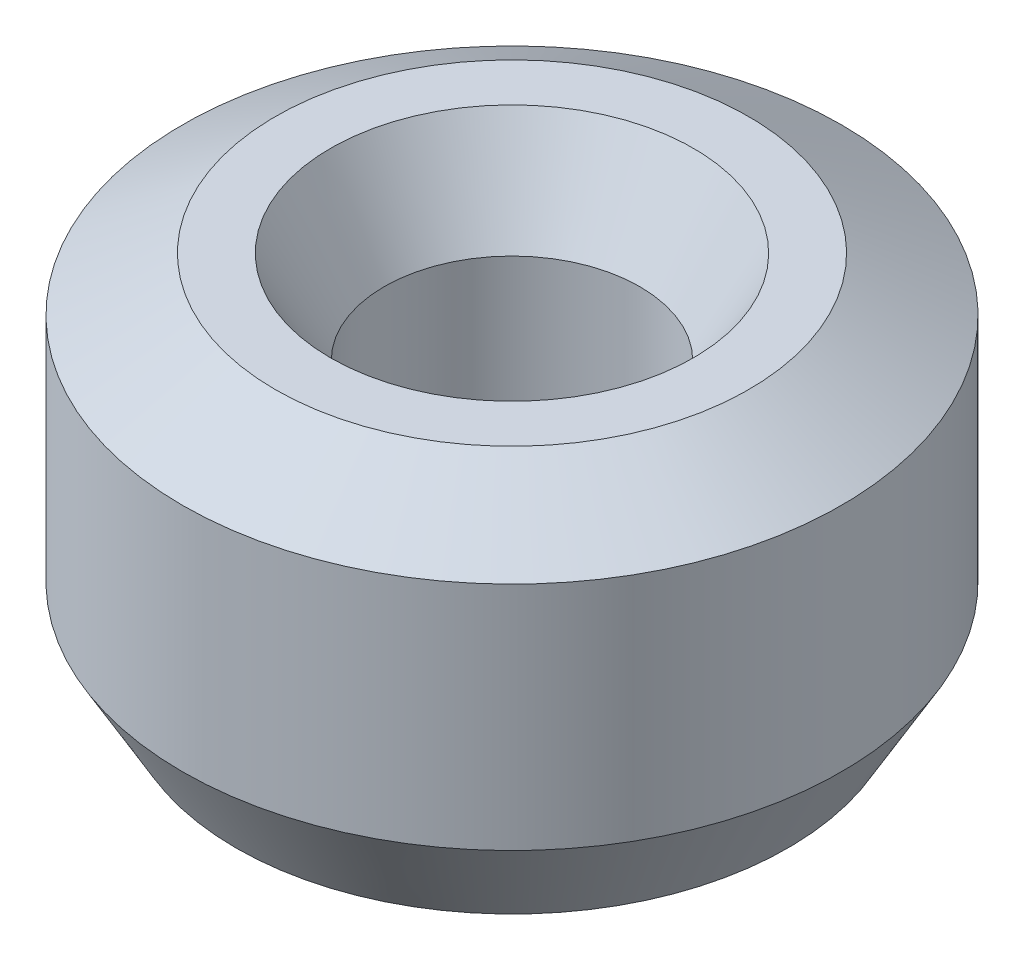
ISO-10303-21;
HEADER;
FILE_DESCRIPTION(('STEP AP214'),'2;1');
FILE_NAME('part.step','',(''),(''),'','','');
FILE_SCHEMA(('AUTOMOTIVE_DESIGN { 1 0 10303 214 1 1 1 1 }'));
ENDSEC;
DATA;
#1=APPLICATION_CONTEXT('core data for automotive mechanical design processes');
#2=APPLICATION_PROTOCOL_DEFINITION('international standard','automotive_design',2000,#1);
#3=PRODUCT_CONTEXT('',#1,'mechanical');
#4=PRODUCT('Part','Part','',(#3));
#5=PRODUCT_RELATED_PRODUCT_CATEGORY('part','',(#4));
#6=PRODUCT_DEFINITION_FORMATION('','',#4);
#7=PRODUCT_DEFINITION_CONTEXT('part definition',#1,'design');
#8=PRODUCT_DEFINITION('design','',#6,#7);
#9=PRODUCT_DEFINITION_SHAPE('','',#8);
#10=(LENGTH_UNIT() NAMED_UNIT(*) SI_UNIT(.MILLI.,.METRE.));
#11=(NAMED_UNIT(*) PLANE_ANGLE_UNIT() SI_UNIT($,.RADIAN.));
#12=(NAMED_UNIT(*) SI_UNIT($,.STERADIAN.) SOLID_ANGLE_UNIT());
#13=UNCERTAINTY_MEASURE_WITH_UNIT(LENGTH_MEASURE(1.E-05),#10,'distance_accuracy_value','');
#14=(GEOMETRIC_REPRESENTATION_CONTEXT(3) GLOBAL_UNCERTAINTY_ASSIGNED_CONTEXT((#13)) GLOBAL_UNIT_ASSIGNED_CONTEXT((#10,
#11,#12)) REPRESENTATION_CONTEXT('',''));
#15=CARTESIAN_POINT('',(0.,0.,0.));
#16=DIRECTION('',(0.,0.,1.));
#17=DIRECTION('',(1.,0.,0.));
#18=AXIS2_PLACEMENT_3D('',#15,#16,#17);
#19=CARTESIAN_POINT('',(0.,25.7634811904174,0.));
#20=DIRECTION('',(0.,-1.,0.));
#21=DIRECTION('',(0.,0.,-1.));
#22=AXIS2_PLACEMENT_3D('',#19,#20,#21);
#23=CYLINDRICAL_SURFACE('',#22,22.5);
#24=CARTESIAN_POINT('',(0.,6.34631982190662,0.));
#25=DIRECTION('',(0.,1.,0.));
#26=DIRECTION('',(0.,0.,1.));
#27=AXIS2_PLACEMENT_3D('',#24,#25,#26);
#28=CIRCLE('',#27,22.5);
#29=CARTESIAN_POINT('',(0.,6.34631982190662,22.5));
#30=VERTEX_POINT('',#29);
#31=EDGE_CURVE('E10',#30,#30,#28,.T.);
#32=ORIENTED_EDGE('',*,*,#31,.T.);
#33=EDGE_LOOP('',(#32));
#34=FACE_BOUND('',#33,.T.);
#35=CARTESIAN_POINT('',(0.,22.0994317328762,0.));
#36=DIRECTION('',(0.,1.,0.));
#37=DIRECTION('',(0.,0.,1.));
#38=AXIS2_PLACEMENT_3D('',#35,#36,#37);
#39=CIRCLE('',#38,22.5);
#40=CARTESIAN_POINT('',(0.,22.0994317328762,22.5));
#41=VERTEX_POINT('',#40);
#42=EDGE_CURVE('E50',#41,#41,#39,.F.);
#43=ORIENTED_EDGE('',*,*,#42,.T.);
#44=EDGE_LOOP('',(#43));
#45=FACE_BOUND('',#44,.T.);
#46=ADVANCED_FACE('F39',(#34,#45),#23,.T.);
#47=CARTESIAN_POINT('',(0.,25.7634811904174,0.));
#48=DIRECTION('',(0.,1.,0.));
#49=DIRECTION('',(0.,0.,1.));
#50=AXIS2_PLACEMENT_3D('',#47,#48,#49);
#51=PLANE('',#50);
#52=CARTESIAN_POINT('',(0.,25.7634811904174,0.));
#53=DIRECTION('',(0.,1.,0.));
#54=DIRECTION('',(0.,0.,1.));
#55=AXIS2_PLACEMENT_3D('',#52,#53,#54);
#56=CIRCLE('',#55,12.3922913216599);
#57=CARTESIAN_POINT('',(0.,25.7634811904174,12.3922913216599));
#58=VERTEX_POINT('',#57);
#59=EDGE_CURVE('E58',#58,#58,#56,.F.);
#60=ORIENTED_EDGE('',*,*,#59,.T.);
#61=EDGE_LOOP('',(#60));
#62=FACE_BOUND('',#61,.T.);
#63=CARTESIAN_POINT('',(0.,25.7634811904174,0.));
#64=DIRECTION('',(0.,1.,0.));
#65=DIRECTION('',(0.,0.,1.));
#66=AXIS2_PLACEMENT_3D('',#63,#64,#65);
#67=CIRCLE('',#66,16.1536801780934);
#68=CARTESIAN_POINT('',(0.,25.7634811904174,16.1536801780934));
#69=VERTEX_POINT('',#68);
#70=EDGE_CURVE('E61',#69,#69,#67,.T.);
#71=ORIENTED_EDGE('',*,*,#70,.T.);
#72=EDGE_LOOP('',(#71));
#73=FACE_BOUND('',#72,.T.);
#74=ADVANCED_FACE('F88',(#62,#73),#51,.T.);
#75=CARTESIAN_POINT('',(0.,0.,0.));
#76=DIRECTION('',(0.,1.,0.));
#77=DIRECTION('',(0.,0.,1.));
#78=AXIS2_PLACEMENT_3D('',#75,#76,#77);
#79=PLANE('',#78);
#80=CARTESIAN_POINT('',(0.,0.,0.));
#81=DIRECTION('',(0.,1.,0.));
#82=DIRECTION('',(0.,0.,1.));
#83=AXIS2_PLACEMENT_3D('',#80,#81,#82);
#84=CIRCLE('',#83,15.0745616860252);
#85=CARTESIAN_POINT('',(0.,0.,-15.0745616860252));
#86=VERTEX_POINT('',#85);
#87=EDGE_CURVE('E51',#86,#86,#84,.T.);
#88=ORIENTED_EDGE('',*,*,#87,.T.);
#89=EDGE_LOOP('',(#88));
#90=FACE_BOUND('',#89,.T.);
#91=CARTESIAN_POINT('',(0.,0.,0.));
#92=DIRECTION('',(0.,1.,0.));
#93=DIRECTION('',(0.,0.,1.));
#94=AXIS2_PLACEMENT_3D('',#91,#92,#93);
#95=CIRCLE('',#94,18.8359505424587);
#96=CARTESIAN_POINT('',(0.,0.,18.8359505424587));
#97=VERTEX_POINT('',#96);
#98=EDGE_CURVE('E54',#97,#97,#95,.F.);
#99=ORIENTED_EDGE('',*,*,#98,.T.);
#100=EDGE_LOOP('',(#99));
#101=FACE_BOUND('',#100,.T.);
#102=ADVANCED_FACE('F83',(#90,#101),#79,.F.);
#103=CARTESIAN_POINT('',(0.,25.7634811904174,0.));
#104=DIRECTION('',(0.,-1.,0.));
#105=DIRECTION('',(0.,0.,-1.));
#106=AXIS2_PLACEMENT_3D('',#103,#104,#105);
#107=CYLINDRICAL_SURFACE('',#106,8.72824186411862);
#108=CARTESIAN_POINT('',(0.,19.4171613685109,0.));
#109=DIRECTION('',(0.,1.,0.));
#110=DIRECTION('',(0.,0.,1.));
#111=AXIS2_PLACEMENT_3D('',#108,#109,#110);
#112=CIRCLE('',#111,8.72824186411862);
#113=CARTESIAN_POINT('',(0.,19.4171613685109,8.72824186411862));
#114=VERTEX_POINT('',#113);
#115=EDGE_CURVE('E67',#114,#114,#112,.T.);
#116=ORIENTED_EDGE('',*,*,#115,.T.);
#117=EDGE_LOOP('',(#116));
#118=FACE_BOUND('',#117,.T.);
#119=CARTESIAN_POINT('',(0.,3.66404945754126,0.));
#120=DIRECTION('',(0.,1.,0.));
#121=DIRECTION('',(0.,0.,1.));
#122=AXIS2_PLACEMENT_3D('',#119,#120,#121);
#123=CIRCLE('',#122,8.72824186411862);
#124=CARTESIAN_POINT('',(0.,3.66404945754126,-8.72824186411862));
#125=VERTEX_POINT('',#124);
#126=EDGE_CURVE('E69',#125,#125,#123,.F.);
#127=ORIENTED_EDGE('',*,*,#126,.T.);
#128=EDGE_LOOP('',(#127));
#129=FACE_BOUND('',#128,.T.);
#130=ADVANCED_FACE('F71',(#118,#129),#107,.F.);
#131=CARTESIAN_POINT('',(0.,19.4171613685109,0.));
#132=DIRECTION('',(0.,1.,0.));
#133=DIRECTION('',(0.,0.,1.));
#134=AXIS2_PLACEMENT_3D('',#131,#132,#133);
#135=CONICAL_SURFACE('',#134,8.72824186411862,0.523598775598302);
#136=ORIENTED_EDGE('',*,*,#59,.F.);
#137=EDGE_LOOP('',(#136));
#138=FACE_BOUND('',#137,.T.);
#139=ORIENTED_EDGE('',*,*,#115,.F.);
#140=EDGE_LOOP('',(#139));
#141=FACE_BOUND('',#140,.T.);
#142=ADVANCED_FACE('F77',(#138,#141),#135,.F.);
#143=CARTESIAN_POINT('',(0.,0.,0.));
#144=DIRECTION('',(0.,-1.,0.));
#145=DIRECTION('',(0.,0.,-1.));
#146=AXIS2_PLACEMENT_3D('',#143,#144,#145);
#147=CONICAL_SURFACE('',#146,15.0745616860252,1.04719755119659);
#148=CARTESIAN_POINT('',(0.,3.66404945754126,-8.72824186411862));
#149=CARTESIAN_POINT('',(0.,3.62588227569187,-8.79434936226347));
#150=CARTESIAN_POINT('',(0.,3.58771509384248,-8.86045686040834));
#151=CARTESIAN_POINT('',(0.,3.5113807301437,-8.99267185669805));
#152=CARTESIAN_POINT('',(0.,3.47321354829432,-9.05877935484292));
#153=CARTESIAN_POINT('',(0.,3.39687918459554,-9.19099435113264));
#154=CARTESIAN_POINT('',(0.,3.35871200274615,-9.2571018492775));
#155=CARTESIAN_POINT('',(0.,3.28237763904738,-9.38931684556722));
#156=CARTESIAN_POINT('',(0.,3.24421045719799,-9.45542434371208));
#157=CARTESIAN_POINT('',(0.,3.16787609349921,-9.5876393400018));
#158=CARTESIAN_POINT('',(0.,3.12970891164982,-9.65374683814666));
#159=CARTESIAN_POINT('',(0.,3.05337454795105,-9.78596183443638));
#160=CARTESIAN_POINT('',(0.,3.01520736610166,-9.85206933258124));
#161=CARTESIAN_POINT('',(0.,2.93887300240288,-9.98428432887096));
#162=CARTESIAN_POINT('',(0.,2.90070582055349,-10.0503918270158));
#163=CARTESIAN_POINT('',(0.,2.82437145685472,-10.1826068233055));
#164=CARTESIAN_POINT('',(0.,2.78620427500533,-10.2487143214504));
#165=CARTESIAN_POINT('',(0.,2.70986991130655,-10.3809293177401));
#166=CARTESIAN_POINT('',(0.,2.67170272945717,-10.447036815885));
#167=CARTESIAN_POINT('',(0.,2.59536836575839,-10.5792518121747));
#168=CARTESIAN_POINT('',(0.,2.557201183909,-10.6453593103196));
#169=CARTESIAN_POINT('',(0.,2.48086682021023,-10.7775743066093));
#170=CARTESIAN_POINT('',(0.,2.44269963836084,-10.8436818047541));
#171=CARTESIAN_POINT('',(0.,2.36636527466206,-10.9758968010439));
#172=CARTESIAN_POINT('',(0.,2.32819809281267,-11.0420042991887));
#173=CARTESIAN_POINT('',(0.,2.2518637291139,-11.1742192954784));
#174=CARTESIAN_POINT('',(0.,2.21369654726451,-11.2403267936233));
#175=CARTESIAN_POINT('',(0.,2.13736218356573,-11.372541789913));
#176=CARTESIAN_POINT('',(0.,2.09919500171634,-11.4386492880579));
#177=CARTESIAN_POINT('',(0.,2.02286063801757,-11.5708642843476));
#178=CARTESIAN_POINT('',(0.,1.98469345616818,-11.6369717824925));
#179=CARTESIAN_POINT('',(0.,1.9083590924694,-11.7691867787822));
#180=CARTESIAN_POINT('',(0.,1.87019191062002,-11.835294276927));
#181=CARTESIAN_POINT('',(0.,1.79385754692124,-11.9675092732168));
#182=CARTESIAN_POINT('',(0.,1.75569036507185,-12.0336167713616));
#183=CARTESIAN_POINT('',(0.,1.67935600137308,-12.1658317676513));
#184=CARTESIAN_POINT('',(0.,1.64118881952369,-12.2319392657962));
#185=CARTESIAN_POINT('',(0.,1.56485445582491,-12.3641542620859));
#186=CARTESIAN_POINT('',(0.,1.52668727397552,-12.4302617602308));
#187=CARTESIAN_POINT('',(0.,1.45035291027675,-12.5624767565205));
#188=CARTESIAN_POINT('',(0.,1.41218572842736,-12.6285842546654));
#189=CARTESIAN_POINT('',(0.,1.33585136472858,-12.7607992509551));
#190=CARTESIAN_POINT('',(0.,1.2976841828792,-12.8269067491));
#191=CARTESIAN_POINT('',(0.,1.22134981918042,-12.9591217453897));
#192=CARTESIAN_POINT('',(0.,1.18318263733103,-13.0252292435345));
#193=CARTESIAN_POINT('',(0.,1.10684827363225,-13.1574442398243));
#194=CARTESIAN_POINT('',(0.,1.06868109178287,-13.2235517379691));
#195=CARTESIAN_POINT('',(0.,0.99234672808409,-13.3557667342588));
#196=CARTESIAN_POINT('',(0.,0.954179546234702,-13.4218742324037));
#197=CARTESIAN_POINT('',(0.,0.877845182535926,-13.5540892286934));
#198=CARTESIAN_POINT('',(0.,0.839678000686538,-13.6201967268383));
#199=CARTESIAN_POINT('',(0.,0.763343636987762,-13.752411723128));
#200=CARTESIAN_POINT('',(0.,0.725176455138374,-13.8185192212729));
#201=CARTESIAN_POINT('',(0.,0.648842091439598,-13.9507342175626));
#202=CARTESIAN_POINT('',(0.,0.610674909590209,-14.0168417157074));
#203=CARTESIAN_POINT('',(0.,0.534340545891433,-14.1490567119972));
#204=CARTESIAN_POINT('',(0.,0.496173364042045,-14.215164210142));
#205=CARTESIAN_POINT('',(0.,0.419839000343269,-14.3473792064317));
#206=CARTESIAN_POINT('',(0.,0.381671818493881,-14.4134867045766));
#207=CARTESIAN_POINT('',(0.,0.305337454795105,-14.5457017008663));
#208=CARTESIAN_POINT('',(0.,0.267170272945717,-14.6118091990112));
#209=CARTESIAN_POINT('',(0.,0.19083590924694,-14.7440241953009));
#210=CARTESIAN_POINT('',(0.,0.152668727397552,-14.8101316934458));
#211=CARTESIAN_POINT('',(0.,0.0763343636987762,-14.9423466897355));
#212=CARTESIAN_POINT('',(0.,0.0381671818493881,-15.0084541878803));
#213=CARTESIAN_POINT('',(0.,0.,-15.0745616860252));
#214=B_SPLINE_CURVE_WITH_KNOTS('',3,(#148,#149,#150,#151,#152,#153,#154,#155,#156,#157,#158,
#159,#160,#161,#162,#163,#164,#165,#166,#167,#168,#169,#170,#171,#172,#173,#174,#175,#176,#177,
#178,#179,#180,#181,#182,#183,#184,#185,#186,#187,#188,#189,#190,#191,#192,#193,#194,#195,#196,
#197,#198,#199,#200,#201,#202,#203,#204,#205,#206,#207,#208,#209,#210,#211,#212,#213),
.UNSPECIFIED.,.F.,.F.,(4,2,2,2,2,2,2,2,2,2,2,2,2,2,2,2,2,2,2,2,2,2,2,2,2,2,2,2,2,2,2,2,4),(0.,
0.229003091096327,0.458006182192654,0.687009273288981,0.916012364385309,1.14501545548164,
1.37401854657796,1.60302163767429,1.83202472877062,2.06102781986694,2.29003091096327,
2.5190340020596,2.74803709315593,2.97704018425225,3.20604327534858,3.43504636644491,
3.66404945754123,3.89305254863756,4.12205563973389,4.35105873083022,4.58006182192654,
4.80906491302287,5.0380680041192,5.26707109521552,5.49607418631185,5.72507727740818,
5.9540803685045,6.18308345960083,6.41208655069716,6.64108964179348,6.87009273288981,
7.09909582398614,7.32809891508246),.UNSPECIFIED.);
#215=EDGE_CURVE('BSEAM73',#125,#86,#214,.T.);
#216=ORIENTED_EDGE('',*,*,#126,.F.);
#217=ORIENTED_EDGE('',*,*,#87,.F.);
#218=ORIENTED_EDGE('',*,*,#215,.T.);
#219=ORIENTED_EDGE('',*,*,#215,.F.);
#220=EDGE_LOOP('',(#216,#218,#217,#219));
#221=FACE_BOUND('',#220,.T.);
#222=ADVANCED_FACE('F73',(#221),#147,.F.);
#223=CARTESIAN_POINT('',(0.,6.34631982190662,0.));
#224=DIRECTION('',(0.,1.,0.));
#225=DIRECTION('',(0.,0.,1.));
#226=AXIS2_PLACEMENT_3D('',#223,#224,#225);
#227=CONICAL_SURFACE('',#226,22.5,0.523598775598302);
#228=CARTESIAN_POINT('',(0.,0.,18.8359505424587));
#229=CARTESIAN_POINT('',(0.,0.0661074981448602,18.8741177243081));
#230=CARTESIAN_POINT('',(0.,0.132214996289721,18.9122849061575));
#231=CARTESIAN_POINT('',(0.,0.264429992579442,18.9886192698563));
#232=CARTESIAN_POINT('',(0.,0.330537490724302,19.0267864517057));
#233=CARTESIAN_POINT('',(0.,0.462752487014023,19.1031208154044));
#234=CARTESIAN_POINT('',(0.,0.528859985158884,19.1412879972538));
#235=CARTESIAN_POINT('',(0.,0.661074981448605,19.2176223609526));
#236=CARTESIAN_POINT('',(0.,0.727182479593465,19.255789542802));
#237=CARTESIAN_POINT('',(0.,0.859397475883187,19.3321239065008));
#238=CARTESIAN_POINT('',(0.,0.925504974028047,19.3702910883502));
#239=CARTESIAN_POINT('',(0.,1.05771997031777,19.4466254520489));
#240=CARTESIAN_POINT('',(0.,1.12382746846263,19.4847926338983));
#241=CARTESIAN_POINT('',(0.,1.25604246475235,19.5611269975971));
#242=CARTESIAN_POINT('',(0.,1.32214996289721,19.5992941794465));
#243=CARTESIAN_POINT('',(0.,1.45436495918693,19.6756285431453));
#244=CARTESIAN_POINT('',(0.,1.52047245733179,19.7137957249947));
#245=CARTESIAN_POINT('',(0.,1.65268745362151,19.7901300886934));
#246=CARTESIAN_POINT('',(0.,1.71879495176637,19.8282972705428));
#247=CARTESIAN_POINT('',(0.,1.8510099480561,19.9046316342416));
#248=CARTESIAN_POINT('',(0.,1.91711744620096,19.942798816091));
#249=CARTESIAN_POINT('',(0.,2.04933244249068,20.0191331797898));
#250=CARTESIAN_POINT('',(0.,2.11543994063554,20.0573003616392));
#251=CARTESIAN_POINT('',(0.,2.24765493692526,20.1336347253379));
#252=CARTESIAN_POINT('',(0.,2.31376243507012,20.1718019071873));
#253=CARTESIAN_POINT('',(0.,2.44597743135984,20.2481362708861));
#254=CARTESIAN_POINT('',(0.,2.5120849295047,20.2863034527355));
#255=CARTESIAN_POINT('',(0.,2.64429992579442,20.3626378164343));
#256=CARTESIAN_POINT('',(0.,2.71040742393928,20.4008049982836));
#257=CARTESIAN_POINT('',(0.,2.842622420229,20.4771393619824));
#258=CARTESIAN_POINT('',(0.,2.90872991837387,20.5153065438318));
#259=CARTESIAN_POINT('',(0.,3.04094491466359,20.5916409075306));
#260=CARTESIAN_POINT('',(0.,3.10705241280845,20.62980808938));
#261=CARTESIAN_POINT('',(0.,3.23926740909817,20.7061424530788));
#262=CARTESIAN_POINT('',(0.,3.30537490724303,20.7443096349281));
#263=CARTESIAN_POINT('',(0.,3.43758990353275,20.8206439986269));
#264=CARTESIAN_POINT('',(0.,3.50369740167761,20.8588111804763));
#265=CARTESIAN_POINT('',(0.,3.63591239796733,20.9351455441751));
#266=CARTESIAN_POINT('',(0.,3.70201989611219,20.9733127260245));
#267=CARTESIAN_POINT('',(0.,3.83423489240191,21.0496470897232));
#268=CARTESIAN_POINT('',(0.,3.90034239054677,21.0878142715726));
#269=CARTESIAN_POINT('',(0.,4.0325573868365,21.1641486352714));
#270=CARTESIAN_POINT('',(0.,4.09866488498136,21.2023158171208));
#271=CARTESIAN_POINT('',(0.,4.23087988127108,21.2786501808196));
#272=CARTESIAN_POINT('',(0.,4.29698737941594,21.316817362669));
#273=CARTESIAN_POINT('',(0.,4.42920237570566,21.3931517263677));
#274=CARTESIAN_POINT('',(0.,4.49530987385052,21.4313189082171));
#275=CARTESIAN_POINT('',(0.,4.62752487014024,21.5076532719159));
#276=CARTESIAN_POINT('',(0.,4.6936323682851,21.5458204537653));
#277=CARTESIAN_POINT('',(0.,4.82584736457482,21.6221548174641));
#278=CARTESIAN_POINT('',(0.,4.89195486271968,21.6603219993135));
#279=CARTESIAN_POINT('',(0.,5.0241698590094,21.7366563630122));
#280=CARTESIAN_POINT('',(0.,5.09027735715426,21.7748235448616));
#281=CARTESIAN_POINT('',(0.,5.22249235344399,21.8511579085604));
#282=CARTESIAN_POINT('',(0.,5.28859985158885,21.8893250904098));
#283=CARTESIAN_POINT('',(0.,5.42081484787857,21.9656594541086));
#284=CARTESIAN_POINT('',(0.,5.48692234602343,22.003826635958));
#285=CARTESIAN_POINT('',(0.,5.61913734231315,22.0801609996567));
#286=CARTESIAN_POINT('',(0.,5.68524484045801,22.1183281815061));
#287=CARTESIAN_POINT('',(0.,5.81745983674773,22.1946625452049));
#288=CARTESIAN_POINT('',(0.,5.88356733489259,22.2328297270543));
#289=CARTESIAN_POINT('',(0.,6.01578233118231,22.3091640907531));
#290=CARTESIAN_POINT('',(0.,6.08188982932717,22.3473312726024));
#291=CARTESIAN_POINT('',(0.,6.21410482561689,22.4236656363012));
#292=CARTESIAN_POINT('',(0.,6.28021232376175,22.4618328181506));
#293=CARTESIAN_POINT('',(0.,6.34631982190662,22.5));
#294=B_SPLINE_CURVE_WITH_KNOTS('',3,(#228,#229,#230,#231,#232,#233,#234,#235,#236,#237,#238,
#239,#240,#241,#242,#243,#244,#245,#246,#247,#248,#249,#250,#251,#252,#253,#254,#255,#256,#257,
#258,#259,#260,#261,#262,#263,#264,#265,#266,#267,#268,#269,#270,#271,#272,#273,#274,#275,#276,
#277,#278,#279,#280,#281,#282,#283,#284,#285,#286,#287,#288,#289,#290,#291,#292,#293),
.UNSPECIFIED.,.F.,.F.,(4,2,2,2,2,2,2,2,2,2,2,2,2,2,2,2,2,2,2,2,2,2,2,2,2,2,2,2,2,2,2,2,4),(0.,
0.229003091096327,0.458006182192655,0.687009273288983,0.916012364385311,1.14501545548164,
1.37401854657797,1.6030216376743,1.83202472877062,2.06102781986695,2.29003091096328,
2.51903400205961,2.74803709315594,2.97704018425226,3.20604327534859,3.43504636644492,
3.66404945754125,3.89305254863758,4.12205563973391,4.35105873083023,4.58006182192656,
4.80906491302289,5.03806800411922,5.26707109521555,5.49607418631188,5.7250772774082,
5.95408036850453,6.18308345960086,6.41208655069719,6.64108964179352,6.87009273288985,
7.09909582398617,7.3280989150825),.UNSPECIFIED.);
#295=EDGE_CURVE('BSEAM76',#97,#30,#294,.T.);
#296=ORIENTED_EDGE('',*,*,#98,.F.);
#297=ORIENTED_EDGE('',*,*,#31,.F.);
#298=ORIENTED_EDGE('',*,*,#295,.T.);
#299=ORIENTED_EDGE('',*,*,#295,.F.);
#300=EDGE_LOOP('',(#296,#298,#297,#299));
#301=FACE_BOUND('',#300,.T.);
#302=ADVANCED_FACE('F76',(#301),#227,.T.);
#303=CARTESIAN_POINT('',(0.,25.7634811904174,0.));
#304=DIRECTION('',(0.,-1.,0.));
#305=DIRECTION('',(0.,0.,-1.));
#306=AXIS2_PLACEMENT_3D('',#303,#304,#305);
#307=CONICAL_SURFACE('',#306,16.1536801780934,1.04719755119659);
#308=ORIENTED_EDGE('',*,*,#42,.F.);
#309=EDGE_LOOP('',(#308));
#310=FACE_BOUND('',#309,.T.);
#311=ORIENTED_EDGE('',*,*,#70,.F.);
#312=EDGE_LOOP('',(#311));
#313=FACE_BOUND('',#312,.T.);
#314=ADVANCED_FACE('F45',(#310,#313),#307,.T.);
#315=CLOSED_SHELL('',(#46,#74,#102,#130,#142,#222,#302,#314));
#316=MANIFOLD_SOLID_BREP('B2',#315);
#317=ADVANCED_BREP_SHAPE_REPRESENTATION('',(#18,#316),#14);
#318=SHAPE_DEFINITION_REPRESENTATION(#9,#317);
ENDSEC;
END-ISO-10303-21;
